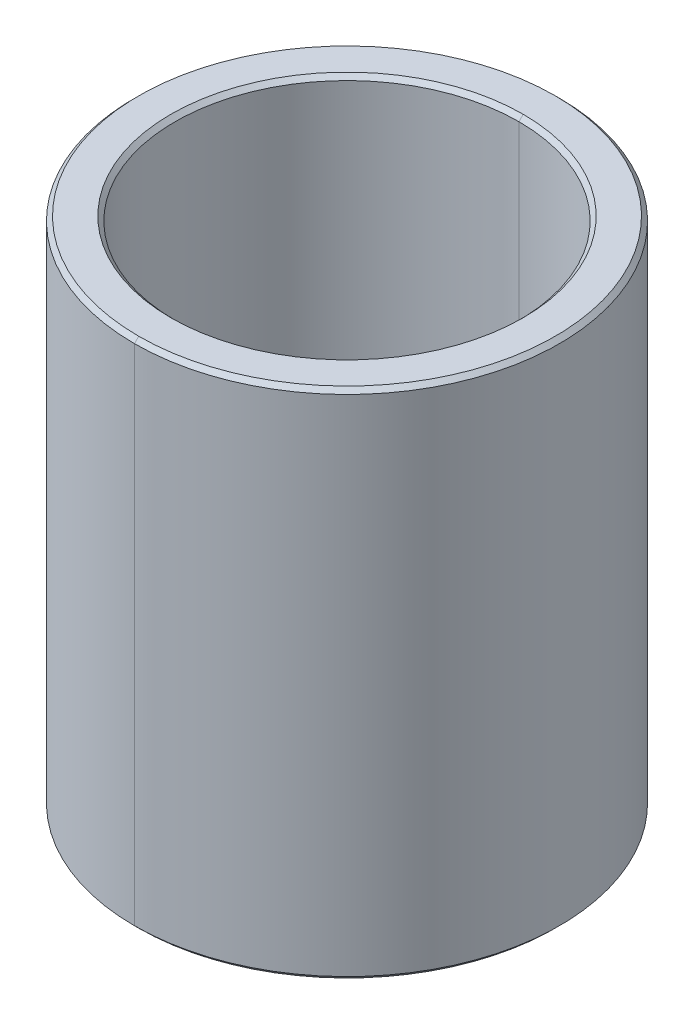
ISO-10303-21;
HEADER;
FILE_DESCRIPTION(('STEP AP214'),'2;1');
FILE_NAME('part.step','',(''),(''),'','','');
FILE_SCHEMA(('AUTOMOTIVE_DESIGN { 1 0 10303 214 1 1 1 1 }'));
ENDSEC;
DATA;
#1=APPLICATION_CONTEXT('core data for automotive mechanical design processes');
#2=APPLICATION_PROTOCOL_DEFINITION('international standard','automotive_design',2000,#1);
#3=PRODUCT_CONTEXT('',#1,'mechanical');
#4=PRODUCT('Part','Part','',(#3));
#5=PRODUCT_RELATED_PRODUCT_CATEGORY('part','',(#4));
#6=PRODUCT_DEFINITION_FORMATION('','',#4);
#7=PRODUCT_DEFINITION_CONTEXT('part definition',#1,'design');
#8=PRODUCT_DEFINITION('design','',#6,#7);
#9=PRODUCT_DEFINITION_SHAPE('','',#8);
#10=(LENGTH_UNIT() NAMED_UNIT(*) SI_UNIT(.MILLI.,.METRE.));
#11=(NAMED_UNIT(*) PLANE_ANGLE_UNIT() SI_UNIT($,.RADIAN.));
#12=(NAMED_UNIT(*) SI_UNIT($,.STERADIAN.) SOLID_ANGLE_UNIT());
#13=UNCERTAINTY_MEASURE_WITH_UNIT(LENGTH_MEASURE(1.E-05),#10,'distance_accuracy_value','');
#14=(GEOMETRIC_REPRESENTATION_CONTEXT(3) GLOBAL_UNCERTAINTY_ASSIGNED_CONTEXT((#13)) GLOBAL_UNIT_ASSIGNED_CONTEXT((#10,
#11,#12)) REPRESENTATION_CONTEXT('',''));
#15=CARTESIAN_POINT('',(0.,0.,0.));
#16=DIRECTION('',(0.,0.,1.));
#17=DIRECTION('',(1.,0.,0.));
#18=AXIS2_PLACEMENT_3D('',#15,#16,#17);
#19=CARTESIAN_POINT('',(0.,5.9,0.));
#20=DIRECTION('',(0.,1.,0.));
#21=DIRECTION('',(0.,0.,1.));
#22=AXIS2_PLACEMENT_3D('',#19,#20,#21);
#23=CONICAL_SURFACE('',#22,4.025,0.785398163397448);
#24=DIRECTION('',(0.,0.707106781186548,-0.707106781186548));
#25=VECTOR('',#24,1.);
#26=CARTESIAN_POINT('',(0.,5.9,-4.025));
#27=LINE('',#26,#25);
#28=CARTESIAN_POINT('',(0.,5.9,-4.025));
#29=VERTEX_POINT('',#28);
#30=CARTESIAN_POINT('',(0.,6.,-4.125));
#31=VERTEX_POINT('',#30);
#32=EDGE_CURVE('E164',#29,#31,#27,.T.);
#33=ORIENTED_EDGE('',*,*,#32,.F.);
#34=CARTESIAN_POINT('',(0.,5.9,0.));
#35=DIRECTION('',(0.,1.,0.));
#36=DIRECTION('',(0.,0.,1.));
#37=AXIS2_PLACEMENT_3D('',#34,#35,#36);
#38=CIRCLE('',#37,4.025);
#39=CARTESIAN_POINT('',(0.,5.9,4.025));
#40=VERTEX_POINT('',#39);
#41=EDGE_CURVE('E26',#40,#29,#38,.T.);
#42=ORIENTED_EDGE('',*,*,#41,.F.);
#43=DIRECTION('',(0.,0.707106781186548,0.707106781186548));
#44=VECTOR('',#43,1.);
#45=CARTESIAN_POINT('',(0.,5.9,4.025));
#46=LINE('',#45,#44);
#47=CARTESIAN_POINT('',(0.,6.,4.125));
#48=VERTEX_POINT('',#47);
#49=EDGE_CURVE('E163',#40,#48,#46,.T.);
#50=ORIENTED_EDGE('',*,*,#49,.T.);
#51=CARTESIAN_POINT('',(0.,6.,0.));
#52=DIRECTION('',(0.,-1.,0.));
#53=DIRECTION('',(0.,0.,1.));
#54=AXIS2_PLACEMENT_3D('',#51,#52,#53);
#55=CIRCLE('',#54,4.125);
#56=EDGE_CURVE('E172',#31,#48,#55,.T.);
#57=ORIENTED_EDGE('',*,*,#56,.F.);
#58=EDGE_LOOP('',(#33,#42,#50,#57));
#59=FACE_BOUND('',#58,.T.);
#60=ADVANCED_FACE('F15',(#59),#23,.F.);
#61=CARTESIAN_POINT('',(0.,-6.,0.));
#62=DIRECTION('',(0.,-1.,0.));
#63=DIRECTION('',(0.,0.,-1.));
#64=AXIS2_PLACEMENT_3D('',#61,#62,#63);
#65=CONICAL_SURFACE('',#64,4.125,0.785398163397452);
#66=DIRECTION('',(0.,-0.707106781186545,0.707106781186551));
#67=VECTOR('',#66,1.);
#68=CARTESIAN_POINT('',(0.,-6.,4.125));
#69=LINE('',#68,#67);
#70=CARTESIAN_POINT('',(0.,-5.9,4.025));
#71=VERTEX_POINT('',#70);
#72=CARTESIAN_POINT('',(0.,-6.,4.125));
#73=VERTEX_POINT('',#72);
#74=EDGE_CURVE('E169',#71,#73,#69,.T.);
#75=ORIENTED_EDGE('',*,*,#74,.F.);
#76=CARTESIAN_POINT('',(0.,-5.9,0.));
#77=DIRECTION('',(0.,-1.,0.));
#78=DIRECTION('',(0.,0.,1.));
#79=AXIS2_PLACEMENT_3D('',#76,#77,#78);
#80=CIRCLE('',#79,4.025);
#81=CARTESIAN_POINT('',(0.,-5.9,-4.025));
#82=VERTEX_POINT('',#81);
#83=EDGE_CURVE('E10',#82,#71,#80,.T.);
#84=ORIENTED_EDGE('',*,*,#83,.F.);
#85=DIRECTION('',(0.,-0.707106781186545,-0.707106781186551));
#86=VECTOR('',#85,1.);
#87=CARTESIAN_POINT('',(0.,-6.,-4.125));
#88=LINE('',#87,#86);
#89=CARTESIAN_POINT('',(0.,-6.,-4.125));
#90=VERTEX_POINT('',#89);
#91=EDGE_CURVE('E173',#82,#90,#88,.T.);
#92=ORIENTED_EDGE('',*,*,#91,.T.);
#93=CARTESIAN_POINT('',(0.,-6.,0.));
#94=DIRECTION('',(0.,1.,0.));
#95=DIRECTION('',(0.,0.,1.));
#96=AXIS2_PLACEMENT_3D('',#93,#94,#95);
#97=CIRCLE('',#96,4.125);
#98=EDGE_CURVE('E69',#73,#90,#97,.T.);
#99=ORIENTED_EDGE('',*,*,#98,.F.);
#100=EDGE_LOOP('',(#75,#84,#92,#99));
#101=FACE_BOUND('',#100,.T.);
#102=ADVANCED_FACE('F198',(#101),#65,.F.);
#103=CARTESIAN_POINT('',(0.,6.,0.));
#104=DIRECTION('',(0.,-1.,0.));
#105=DIRECTION('',(0.,0.,-1.));
#106=AXIS2_PLACEMENT_3D('',#103,#104,#105);
#107=CONICAL_SURFACE('',#106,4.875,0.78539816339744);
#108=DIRECTION('',(0.,-0.707106781186554,0.707106781186542));
#109=VECTOR('',#108,1.);
#110=CARTESIAN_POINT('',(0.,6.,4.875));
#111=LINE('',#110,#109);
#112=CARTESIAN_POINT('',(0.,6.,4.875));
#113=VERTEX_POINT('',#112);
#114=CARTESIAN_POINT('',(0.,5.9,4.975));
#115=VERTEX_POINT('',#114);
#116=EDGE_CURVE('E139',#113,#115,#111,.T.);
#117=ORIENTED_EDGE('',*,*,#116,.F.);
#118=CARTESIAN_POINT('',(0.,6.,0.));
#119=DIRECTION('',(0.,1.,0.));
#120=DIRECTION('',(0.,0.,1.));
#121=AXIS2_PLACEMENT_3D('',#118,#119,#120);
#122=CIRCLE('',#121,4.875);
#123=CARTESIAN_POINT('',(0.,6.,-4.875));
#124=VERTEX_POINT('',#123);
#125=EDGE_CURVE('E127',#124,#113,#122,.T.);
#126=ORIENTED_EDGE('',*,*,#125,.F.);
#127=DIRECTION('',(0.,-0.707106781186554,-0.707106781186542));
#128=VECTOR('',#127,1.);
#129=CARTESIAN_POINT('',(0.,6.,-4.875));
#130=LINE('',#129,#128);
#131=CARTESIAN_POINT('',(0.,5.9,-4.975));
#132=VERTEX_POINT('',#131);
#133=EDGE_CURVE('E130',#124,#132,#130,.T.);
#134=ORIENTED_EDGE('',*,*,#133,.T.);
#135=CARTESIAN_POINT('',(0.,5.9,0.));
#136=DIRECTION('',(0.,-1.,0.));
#137=DIRECTION('',(0.,0.,1.));
#138=AXIS2_PLACEMENT_3D('',#135,#136,#137);
#139=CIRCLE('',#138,4.975);
#140=EDGE_CURVE('E19',#115,#132,#139,.T.);
#141=ORIENTED_EDGE('',*,*,#140,.F.);
#142=EDGE_LOOP('',(#117,#126,#134,#141));
#143=FACE_BOUND('',#142,.T.);
#144=ADVANCED_FACE('F131',(#143),#107,.T.);
#145=CARTESIAN_POINT('',(0.,-5.9,0.));
#146=DIRECTION('',(0.,1.,0.));
#147=DIRECTION('',(0.,0.,1.));
#148=AXIS2_PLACEMENT_3D('',#145,#146,#147);
#149=CONICAL_SURFACE('',#148,4.975,0.785398163397443);
#150=DIRECTION('',(0.,0.707106781186551,-0.707106781186545));
#151=VECTOR('',#150,1.);
#152=CARTESIAN_POINT('',(0.,-5.9,-4.975));
#153=LINE('',#152,#151);
#154=CARTESIAN_POINT('',(0.,-6.,-4.875));
#155=VERTEX_POINT('',#154);
#156=CARTESIAN_POINT('',(0.,-5.9,-4.975));
#157=VERTEX_POINT('',#156);
#158=EDGE_CURVE('E158',#155,#157,#153,.T.);
#159=ORIENTED_EDGE('',*,*,#158,.F.);
#160=CARTESIAN_POINT('',(0.,-6.,0.));
#161=DIRECTION('',(0.,-1.,0.));
#162=DIRECTION('',(0.,0.,1.));
#163=AXIS2_PLACEMENT_3D('',#160,#161,#162);
#164=CIRCLE('',#163,4.875);
#165=CARTESIAN_POINT('',(0.,-6.,4.875));
#166=VERTEX_POINT('',#165);
#167=EDGE_CURVE('E246',#166,#155,#164,.T.);
#168=ORIENTED_EDGE('',*,*,#167,.F.);
#169=DIRECTION('',(0.,0.707106781186551,0.707106781186545));
#170=VECTOR('',#169,1.);
#171=CARTESIAN_POINT('',(0.,-5.9,4.975));
#172=LINE('',#171,#170);
#173=CARTESIAN_POINT('',(0.,-5.9,4.975));
#174=VERTEX_POINT('',#173);
#175=EDGE_CURVE('E157',#166,#174,#172,.T.);
#176=ORIENTED_EDGE('',*,*,#175,.T.);
#177=CARTESIAN_POINT('',(0.,-5.9,0.));
#178=DIRECTION('',(0.,1.,0.));
#179=DIRECTION('',(0.,0.,1.));
#180=AXIS2_PLACEMENT_3D('',#177,#178,#179);
#181=CIRCLE('',#180,4.975);
#182=EDGE_CURVE('E41',#157,#174,#181,.T.);
#183=ORIENTED_EDGE('',*,*,#182,.F.);
#184=EDGE_LOOP('',(#159,#168,#176,#183));
#185=FACE_BOUND('',#184,.T.);
#186=ADVANCED_FACE('F364',(#185),#149,.T.);
#187=CARTESIAN_POINT('',(0.,6.,0.));
#188=DIRECTION('',(0.,-1.,0.));
#189=DIRECTION('',(0.,0.,-1.));
#190=AXIS2_PLACEMENT_3D('',#187,#188,#189);
#191=CYLINDRICAL_SURFACE('',#190,4.025);
#192=DIRECTION('',(0.,-1.,0.));
#193=VECTOR('',#192,1.);
#194=CARTESIAN_POINT('',(0.,6.,4.025));
#195=LINE('',#194,#193);
#196=EDGE_CURVE('E226',#40,#71,#195,.T.);
#197=ORIENTED_EDGE('',*,*,#196,.F.);
#198=ORIENTED_EDGE('',*,*,#41,.T.);
#199=DIRECTION('',(0.,-1.,0.));
#200=VECTOR('',#199,1.);
#201=CARTESIAN_POINT('',(0.,6.,-4.025));
#202=LINE('',#201,#200);
#203=EDGE_CURVE('E154',#29,#82,#202,.T.);
#204=ORIENTED_EDGE('',*,*,#203,.T.);
#205=ORIENTED_EDGE('',*,*,#83,.T.);
#206=EDGE_LOOP('',(#197,#198,#204,#205));
#207=FACE_BOUND('',#206,.T.);
#208=ADVANCED_FACE('F368',(#207),#191,.F.);
#209=CARTESIAN_POINT('',(0.,6.,0.));
#210=DIRECTION('',(0.,-1.,0.));
#211=DIRECTION('',(0.,0.,-1.));
#212=AXIS2_PLACEMENT_3D('',#209,#210,#211);
#213=CYLINDRICAL_SURFACE('',#212,4.975);
#214=DIRECTION('',(0.,-1.,0.));
#215=VECTOR('',#214,1.);
#216=CARTESIAN_POINT('',(0.,6.,4.975));
#217=LINE('',#216,#215);
#218=EDGE_CURVE('E115',#115,#174,#217,.T.);
#219=ORIENTED_EDGE('',*,*,#218,.F.);
#220=ORIENTED_EDGE('',*,*,#140,.T.);
#221=DIRECTION('',(0.,-1.,0.));
#222=VECTOR('',#221,1.);
#223=CARTESIAN_POINT('',(0.,6.,-4.975));
#224=LINE('',#223,#222);
#225=EDGE_CURVE('E113',#132,#157,#224,.T.);
#226=ORIENTED_EDGE('',*,*,#225,.T.);
#227=ORIENTED_EDGE('',*,*,#182,.T.);
#228=EDGE_LOOP('',(#219,#220,#226,#227));
#229=FACE_BOUND('',#228,.T.);
#230=ADVANCED_FACE('F17',(#229),#213,.T.);
#231=CARTESIAN_POINT('',(0.,-6.,0.));
#232=DIRECTION('',(0.,1.,0.));
#233=DIRECTION('',(1.,0.,0.));
#234=AXIS2_PLACEMENT_3D('',#231,#232,#233);
#235=PLANE('',#234);
#236=CARTESIAN_POINT('',(0.,-6.,0.));
#237=DIRECTION('',(0.,1.,0.));
#238=DIRECTION('',(0.,0.,1.));
#239=AXIS2_PLACEMENT_3D('',#236,#237,#238);
#240=CIRCLE('',#239,4.125);
#241=EDGE_CURVE('E176',#90,#73,#240,.T.);
#242=ORIENTED_EDGE('',*,*,#241,.T.);
#243=ORIENTED_EDGE('',*,*,#98,.T.);
#244=EDGE_LOOP('',(#242,#243));
#245=FACE_BOUND('',#244,.T.);
#246=ORIENTED_EDGE('',*,*,#167,.T.);
#247=CARTESIAN_POINT('',(0.,-6.,0.));
#248=DIRECTION('',(0.,-1.,0.));
#249=DIRECTION('',(0.,0.,1.));
#250=AXIS2_PLACEMENT_3D('',#247,#248,#249);
#251=CIRCLE('',#250,4.875);
#252=EDGE_CURVE('E136',#155,#166,#251,.T.);
#253=ORIENTED_EDGE('',*,*,#252,.T.);
#254=EDGE_LOOP('',(#246,#253));
#255=FACE_BOUND('',#254,.T.);
#256=ADVANCED_FACE('F184',(#245,#255),#235,.F.);
#257=CARTESIAN_POINT('',(0.,6.,0.));
#258=DIRECTION('',(0.,1.,0.));
#259=DIRECTION('',(1.,0.,0.));
#260=AXIS2_PLACEMENT_3D('',#257,#258,#259);
#261=PLANE('',#260);
#262=CARTESIAN_POINT('',(0.,6.,0.));
#263=DIRECTION('',(0.,-1.,0.));
#264=DIRECTION('',(0.,0.,1.));
#265=AXIS2_PLACEMENT_3D('',#262,#263,#264);
#266=CIRCLE('',#265,4.125);
#267=EDGE_CURVE('E159',#48,#31,#266,.T.);
#268=ORIENTED_EDGE('',*,*,#267,.T.);
#269=ORIENTED_EDGE('',*,*,#56,.T.);
#270=EDGE_LOOP('',(#268,#269));
#271=FACE_BOUND('',#270,.T.);
#272=ORIENTED_EDGE('',*,*,#125,.T.);
#273=CARTESIAN_POINT('',(0.,6.,0.));
#274=DIRECTION('',(0.,1.,0.));
#275=DIRECTION('',(0.,0.,1.));
#276=AXIS2_PLACEMENT_3D('',#273,#274,#275);
#277=CIRCLE('',#276,4.875);
#278=EDGE_CURVE('E146',#113,#124,#277,.T.);
#279=ORIENTED_EDGE('',*,*,#278,.T.);
#280=EDGE_LOOP('',(#272,#279));
#281=FACE_BOUND('',#280,.T.);
#282=ADVANCED_FACE('F182',(#271,#281),#261,.T.);
#283=CARTESIAN_POINT('',(0.,6.,0.));
#284=DIRECTION('',(0.,-1.,0.));
#285=DIRECTION('',(0.,0.,-1.));
#286=AXIS2_PLACEMENT_3D('',#283,#284,#285);
#287=CYLINDRICAL_SURFACE('',#286,4.975);
#288=CARTESIAN_POINT('',(0.,5.9,0.));
#289=DIRECTION('',(0.,-1.,0.));
#290=DIRECTION('',(0.,0.,1.));
#291=AXIS2_PLACEMENT_3D('',#288,#289,#290);
#292=CIRCLE('',#291,4.975);
#293=EDGE_CURVE('E121',#132,#115,#292,.T.);
#294=ORIENTED_EDGE('',*,*,#293,.T.);
#295=ORIENTED_EDGE('',*,*,#218,.T.);
#296=CARTESIAN_POINT('',(0.,-5.9,0.));
#297=DIRECTION('',(0.,1.,0.));
#298=DIRECTION('',(0.,0.,1.));
#299=AXIS2_PLACEMENT_3D('',#296,#297,#298);
#300=CIRCLE('',#299,4.975);
#301=EDGE_CURVE('E124',#174,#157,#300,.T.);
#302=ORIENTED_EDGE('',*,*,#301,.T.);
#303=ORIENTED_EDGE('',*,*,#225,.F.);
#304=EDGE_LOOP('',(#294,#295,#302,#303));
#305=FACE_BOUND('',#304,.T.);
#306=ADVANCED_FACE('F119',(#305),#287,.T.);
#307=CARTESIAN_POINT('',(0.,6.,0.));
#308=DIRECTION('',(0.,-1.,0.));
#309=DIRECTION('',(0.,0.,-1.));
#310=AXIS2_PLACEMENT_3D('',#307,#308,#309);
#311=CYLINDRICAL_SURFACE('',#310,4.025);
#312=CARTESIAN_POINT('',(0.,5.9,0.));
#313=DIRECTION('',(0.,1.,0.));
#314=DIRECTION('',(0.,0.,1.));
#315=AXIS2_PLACEMENT_3D('',#312,#313,#314);
#316=CIRCLE('',#315,4.025);
#317=EDGE_CURVE('E149',#29,#40,#316,.T.);
#318=ORIENTED_EDGE('',*,*,#317,.T.);
#319=ORIENTED_EDGE('',*,*,#196,.T.);
#320=CARTESIAN_POINT('',(0.,-5.9,0.));
#321=DIRECTION('',(0.,-1.,0.));
#322=DIRECTION('',(0.,0.,1.));
#323=AXIS2_PLACEMENT_3D('',#320,#321,#322);
#324=CIRCLE('',#323,4.025);
#325=EDGE_CURVE('E165',#71,#82,#324,.T.);
#326=ORIENTED_EDGE('',*,*,#325,.T.);
#327=ORIENTED_EDGE('',*,*,#203,.F.);
#328=EDGE_LOOP('',(#318,#319,#326,#327));
#329=FACE_BOUND('',#328,.T.);
#330=ADVANCED_FACE('F192',(#329),#311,.F.);
#331=CARTESIAN_POINT('',(0.,-5.9,0.));
#332=DIRECTION('',(0.,1.,0.));
#333=DIRECTION('',(0.,0.,1.));
#334=AXIS2_PLACEMENT_3D('',#331,#332,#333);
#335=CONICAL_SURFACE('',#334,4.975,0.785398163397443);
#336=ORIENTED_EDGE('',*,*,#252,.F.);
#337=ORIENTED_EDGE('',*,*,#158,.T.);
#338=ORIENTED_EDGE('',*,*,#301,.F.);
#339=ORIENTED_EDGE('',*,*,#175,.F.);
#340=EDGE_LOOP('',(#336,#337,#338,#339));
#341=FACE_BOUND('',#340,.T.);
#342=ADVANCED_FACE('F215',(#341),#335,.T.);
#343=CARTESIAN_POINT('',(0.,6.,0.));
#344=DIRECTION('',(0.,-1.,0.));
#345=DIRECTION('',(0.,0.,-1.));
#346=AXIS2_PLACEMENT_3D('',#343,#344,#345);
#347=CONICAL_SURFACE('',#346,4.875,0.78539816339744);
#348=ORIENTED_EDGE('',*,*,#278,.F.);
#349=ORIENTED_EDGE('',*,*,#116,.T.);
#350=ORIENTED_EDGE('',*,*,#293,.F.);
#351=ORIENTED_EDGE('',*,*,#133,.F.);
#352=EDGE_LOOP('',(#348,#349,#350,#351));
#353=FACE_BOUND('',#352,.T.);
#354=ADVANCED_FACE('F138',(#353),#347,.T.);
#355=CARTESIAN_POINT('',(0.,-6.,0.));
#356=DIRECTION('',(0.,-1.,0.));
#357=DIRECTION('',(0.,0.,-1.));
#358=AXIS2_PLACEMENT_3D('',#355,#356,#357);
#359=CONICAL_SURFACE('',#358,4.125,0.785398163397452);
#360=ORIENTED_EDGE('',*,*,#325,.F.);
#361=ORIENTED_EDGE('',*,*,#74,.T.);
#362=ORIENTED_EDGE('',*,*,#241,.F.);
#363=ORIENTED_EDGE('',*,*,#91,.F.);
#364=EDGE_LOOP('',(#360,#361,#362,#363));
#365=FACE_BOUND('',#364,.T.);
#366=ADVANCED_FACE('F208',(#365),#359,.F.);
#367=CARTESIAN_POINT('',(0.,5.9,0.));
#368=DIRECTION('',(0.,1.,0.));
#369=DIRECTION('',(0.,0.,1.));
#370=AXIS2_PLACEMENT_3D('',#367,#368,#369);
#371=CONICAL_SURFACE('',#370,4.025,0.785398163397448);
#372=ORIENTED_EDGE('',*,*,#317,.F.);
#373=ORIENTED_EDGE('',*,*,#32,.T.);
#374=ORIENTED_EDGE('',*,*,#267,.F.);
#375=ORIENTED_EDGE('',*,*,#49,.F.);
#376=EDGE_LOOP('',(#372,#373,#374,#375));
#377=FACE_BOUND('',#376,.T.);
#378=ADVANCED_FACE('F206',(#377),#371,.F.);
#379=CLOSED_SHELL('',(#60,#102,#144,#186,#208,#230,#256,#282,#306,#330,#342,#354,#366,#378));
#380=MANIFOLD_SOLID_BREP('B1',#379);
#381=ADVANCED_BREP_SHAPE_REPRESENTATION('',(#18,#380),#14);
#382=SHAPE_DEFINITION_REPRESENTATION(#9,#381);
ENDSEC;
END-ISO-10303-21;
